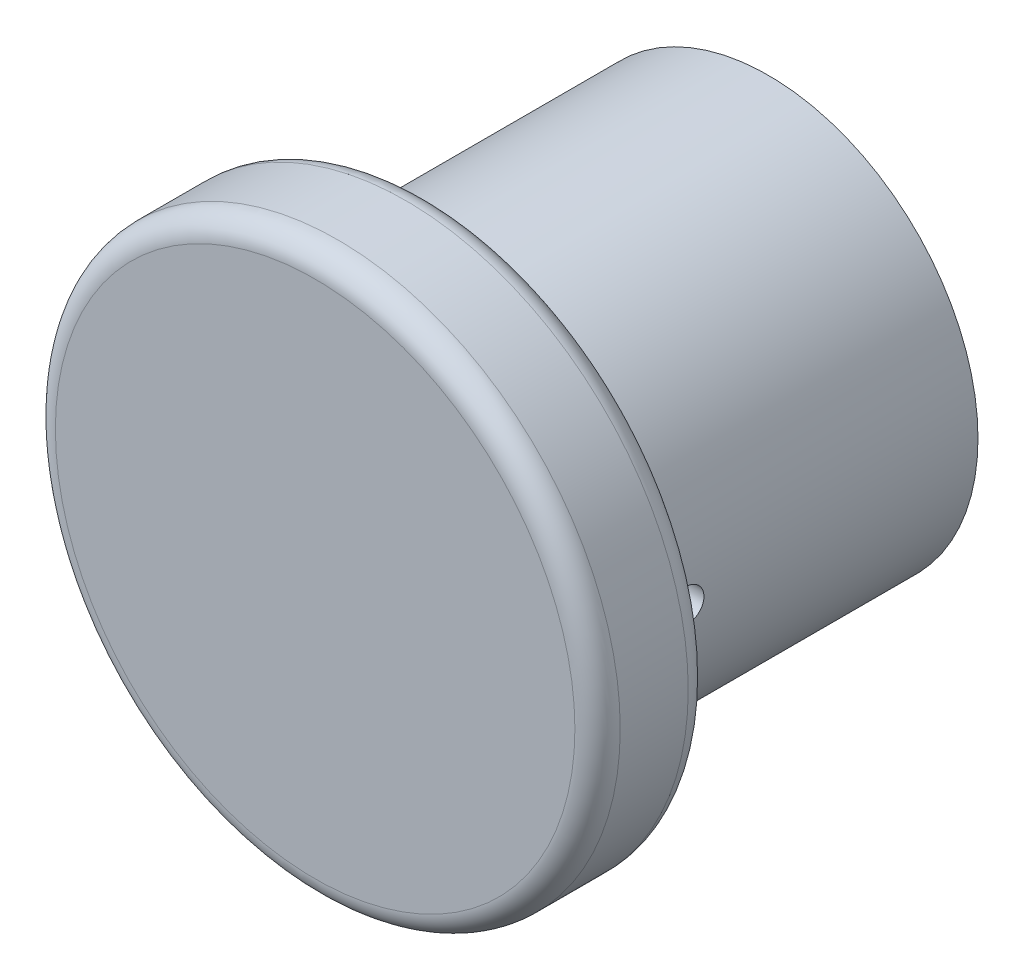
ISO-10303-21;
HEADER;
FILE_DESCRIPTION(('STEP AP214'),'2;1');
FILE_NAME('part.step','',(''),(''),'','','');
FILE_SCHEMA(('AUTOMOTIVE_DESIGN { 1 0 10303 214 1 1 1 1 }'));
ENDSEC;
DATA;
#1=APPLICATION_CONTEXT('core data for automotive mechanical design processes');
#2=APPLICATION_PROTOCOL_DEFINITION('international standard','automotive_design',2000,#1);
#3=PRODUCT_CONTEXT('',#1,'mechanical');
#4=PRODUCT('Part','Part','',(#3));
#5=PRODUCT_RELATED_PRODUCT_CATEGORY('part','',(#4));
#6=PRODUCT_DEFINITION_FORMATION('','',#4);
#7=PRODUCT_DEFINITION_CONTEXT('part definition',#1,'design');
#8=PRODUCT_DEFINITION('design','',#6,#7);
#9=PRODUCT_DEFINITION_SHAPE('','',#8);
#10=(LENGTH_UNIT() NAMED_UNIT(*) SI_UNIT(.MILLI.,.METRE.));
#11=(NAMED_UNIT(*) PLANE_ANGLE_UNIT() SI_UNIT($,.RADIAN.));
#12=(NAMED_UNIT(*) SI_UNIT($,.STERADIAN.) SOLID_ANGLE_UNIT());
#13=UNCERTAINTY_MEASURE_WITH_UNIT(LENGTH_MEASURE(1.E-05),#10,'distance_accuracy_value','');
#14=(GEOMETRIC_REPRESENTATION_CONTEXT(3) GLOBAL_UNCERTAINTY_ASSIGNED_CONTEXT((#13)) GLOBAL_UNIT_ASSIGNED_CONTEXT((#10,
#11,#12)) REPRESENTATION_CONTEXT('',''));
#15=CARTESIAN_POINT('',(0.,0.,0.));
#16=DIRECTION('',(0.,0.,1.));
#17=DIRECTION('',(1.,0.,0.));
#18=AXIS2_PLACEMENT_3D('',#15,#16,#17);
#19=CARTESIAN_POINT('',(0.,0.,0.));
#20=DIRECTION('',(0.,0.,1.));
#21=DIRECTION('',(1.,0.,0.));
#22=AXIS2_PLACEMENT_3D('',#19,#20,#21);
#23=PLANE('',#22);
#24=CARTESIAN_POINT('',(0.,0.,0.));
#25=DIRECTION('',(0.,0.,1.));
#26=DIRECTION('',(1.,0.,0.));
#27=AXIS2_PLACEMENT_3D('',#24,#25,#26);
#28=CIRCLE('',#27,11.461427854);
#29=CARTESIAN_POINT('',(11.461427854,0.,0.));
#30=VERTEX_POINT('',#29);
#31=EDGE_CURVE('E52',#30,#30,#28,.F.);
#32=ORIENTED_EDGE('',*,*,#31,.T.);
#33=EDGE_LOOP('',(#32));
#34=FACE_BOUND('',#33,.T.);
#35=CARTESIAN_POINT('',(0.,0.,0.));
#36=DIRECTION('',(0.,0.,1.));
#37=DIRECTION('',(1.,0.,0.));
#38=AXIS2_PLACEMENT_3D('',#35,#36,#37);
#39=CIRCLE('',#38,10.246210184);
#40=CARTESIAN_POINT('',(10.246210184,0.,0.));
#41=VERTEX_POINT('',#40);
#42=EDGE_CURVE('E55',#41,#41,#39,.T.);
#43=ORIENTED_EDGE('',*,*,#42,.T.);
#44=EDGE_LOOP('',(#43));
#45=FACE_BOUND('',#44,.T.);
#46=ADVANCED_FACE('F32',(#34,#45),#23,.F.);
#47=CARTESIAN_POINT('',(0.,0.,5.));
#48=DIRECTION('',(0.,0.,-1.));
#49=DIRECTION('',(-1.,0.,0.));
#50=AXIS2_PLACEMENT_3D('',#47,#48,#49);
#51=CYLINDRICAL_SURFACE('',#50,12.461427854);
#52=CARTESIAN_POINT('',(0.,0.,1.));
#53=DIRECTION('',(0.,0.,1.));
#54=DIRECTION('',(1.,0.,0.));
#55=AXIS2_PLACEMENT_3D('',#52,#53,#54);
#56=CIRCLE('',#55,12.461427854);
#57=CARTESIAN_POINT('',(12.461427854,0.,1.));
#58=VERTEX_POINT('',#57);
#59=EDGE_CURVE('E43',#58,#58,#56,.T.);
#60=ORIENTED_EDGE('',*,*,#59,.T.);
#61=EDGE_LOOP('',(#60));
#62=FACE_BOUND('',#61,.T.);
#63=CARTESIAN_POINT('',(0.,0.,4.));
#64=DIRECTION('',(0.,0.,1.));
#65=DIRECTION('',(1.,0.,0.));
#66=AXIS2_PLACEMENT_3D('',#63,#64,#65);
#67=CIRCLE('',#66,12.461427854);
#68=CARTESIAN_POINT('',(12.461427854,0.,4.));
#69=VERTEX_POINT('',#68);
#70=EDGE_CURVE('E47',#69,#69,#67,.F.);
#71=ORIENTED_EDGE('',*,*,#70,.T.);
#72=EDGE_LOOP('',(#71));
#73=FACE_BOUND('',#72,.T.);
#74=ADVANCED_FACE('F34',(#62,#73),#51,.T.);
#75=CARTESIAN_POINT('',(0.,0.,5.));
#76=DIRECTION('',(0.,0.,1.));
#77=DIRECTION('',(1.,0.,0.));
#78=AXIS2_PLACEMENT_3D('',#75,#76,#77);
#79=PLANE('',#78);
#80=CARTESIAN_POINT('',(0.,0.,5.));
#81=DIRECTION('',(0.,0.,1.));
#82=DIRECTION('',(1.,0.,0.));
#83=AXIS2_PLACEMENT_3D('',#80,#81,#82);
#84=CIRCLE('',#83,11.461427854);
#85=CARTESIAN_POINT('',(11.461427854,0.,5.));
#86=VERTEX_POINT('',#85);
#87=EDGE_CURVE('E11',#86,#86,#84,.T.);
#88=ORIENTED_EDGE('',*,*,#87,.T.);
#89=EDGE_LOOP('',(#88));
#90=FACE_BOUND('',#89,.T.);
#91=ADVANCED_FACE('F100',(#90),#79,.T.);
#92=CARTESIAN_POINT('',(0.,0.,-15.));
#93=DIRECTION('',(0.,0.,1.));
#94=DIRECTION('',(1.,0.,0.));
#95=AXIS2_PLACEMENT_3D('',#92,#93,#94);
#96=CYLINDRICAL_SURFACE('',#95,9.246210184);
#97=CARTESIAN_POINT('',(0.,0.,-1.));
#98=DIRECTION('',(0.,0.,1.));
#99=DIRECTION('',(1.,0.,0.));
#100=AXIS2_PLACEMENT_3D('',#97,#98,#99);
#101=CIRCLE('',#100,9.246210184);
#102=CARTESIAN_POINT('',(9.246210184,0.,-1.));
#103=VERTEX_POINT('',#102);
#104=EDGE_CURVE('E39',#103,#103,#101,.F.);
#105=ORIENTED_EDGE('',*,*,#104,.T.);
#106=EDGE_LOOP('',(#105));
#107=FACE_BOUND('',#106,.T.);
#108=CARTESIAN_POINT('',(9.246210184,0.,-2.909005151));
#109=CARTESIAN_POINT('',(9.24620979681304,-0.0413957006711444,-2.90900334028285));
#110=CARTESIAN_POINT('',(9.24592922303125,-0.0828197328417742,-2.90551156817986));
#111=CARTESIAN_POINT('',(9.2448369344386,-0.164522110775543,-2.89163336871054));
#112=CARTESIAN_POINT('',(9.24402461480983,-0.204799097365389,-2.88123909010611));
#113=CARTESIAN_POINT('',(9.24196064919478,-0.283012224778952,-2.853857989299));
#114=CARTESIAN_POINT('',(9.24070924868002,-0.320949659642295,-2.83687485008955));
#115=CARTESIAN_POINT('',(9.23790753586561,-0.393426148978988,-2.79680459425711));
#116=CARTESIAN_POINT('',(9.23635728836858,-0.427965937757503,-2.77371880054487));
#117=CARTESIAN_POINT('',(9.23312781758184,-0.492757147757313,-2.72203980952776));
#118=CARTESIAN_POINT('',(9.2314483322434,-0.522999482157884,-2.69343523523433));
#119=CARTESIAN_POINT('',(9.22815187947331,-0.578259385016817,-2.63155462767365));
#120=CARTESIAN_POINT('',(9.2265349147647,-0.603276726112222,-2.59827839122667));
#121=CARTESIAN_POINT('',(9.22354371913614,-0.647406877193839,-2.52794451230455));
#122=CARTESIAN_POINT('',(9.22216981510871,-0.666511760984308,-2.49088188153927));
#123=CARTESIAN_POINT('',(9.21982322430151,-0.698224038797599,-2.41406208508506));
#124=CARTESIAN_POINT('',(9.21885053095775,-0.710831539121319,-2.37430496349158));
#125=CARTESIAN_POINT('',(9.21741864500708,-0.729164965982102,-2.29331533625684));
#126=CARTESIAN_POINT('',(9.21695835338318,-0.734905622743441,-2.2520861848093));
#127=CARTESIAN_POINT('',(9.21659989400513,-0.739387906396724,-2.16924713485922));
#128=CARTESIAN_POINT('',(9.21670171648738,-0.738129654855505,-2.12763724298246));
#129=CARTESIAN_POINT('',(9.21745498376225,-0.728662020913646,-2.04531870103828));
#130=CARTESIAN_POINT('',(9.21810516378412,-0.720468634044991,-2.00460819810095));
#131=CARTESIAN_POINT('',(9.21987989969181,-0.697388152921827,-1.92514211519331));
#132=CARTESIAN_POINT('',(9.22100445987682,-0.682500998003543,-1.88638655294362));
#133=CARTESIAN_POINT('',(9.22360269840569,-0.646437616125899,-1.81187942516979));
#134=CARTESIAN_POINT('',(9.22507677556543,-0.62525419777085,-1.77613135493921));
#135=CARTESIAN_POINT('',(9.22820757801592,-0.577204797034953,-1.70869218842976));
#136=CARTESIAN_POINT('',(9.22986430669737,-0.550338709153741,-1.67700116748868));
#137=CARTESIAN_POINT('',(9.23317935969137,-0.491596814295881,-1.61848267485407));
#138=CARTESIAN_POINT('',(9.23483767546002,-0.459707176252819,-1.59166908458135));
#139=CARTESIAN_POINT('',(9.23796461528914,-0.391871707067114,-1.54377387287056));
#140=CARTESIAN_POINT('',(9.23943323923609,-0.35592587349732,-1.52269225486243));
#141=CARTESIAN_POINT('',(9.24201556511307,-0.280989473110397,-1.48686033941056));
#142=CARTESIAN_POINT('',(9.24312923351135,-0.24199861907093,-1.47211064008128));
#143=CARTESIAN_POINT('',(9.24487577158201,-0.162083054255314,-1.44937088676647));
#144=CARTESIAN_POINT('',(9.24550865041336,-0.121158380334004,-1.44138070401255));
#145=CARTESIAN_POINT('',(9.24622112415009,-0.0386572204441502,-1.43240416165275));
#146=CARTESIAN_POINT('',(9.24630223400072,0.00291716641788696,-1.43139862473734));
#147=CARTESIAN_POINT('',(9.24590607381375,0.0856433621780159,-1.43636970416433));
#148=CARTESIAN_POINT('',(9.24542880855119,0.12679517468677,-1.44234626079848));
#149=CARTESIAN_POINT('',(9.24397055649382,0.207453515472858,-1.46109598302385));
#150=CARTESIAN_POINT('',(9.24299022729705,0.246962119023409,-1.47386027657006));
#151=CARTESIAN_POINT('',(9.24063600421867,0.323276779037239,-1.50581408934175));
#152=CARTESIAN_POINT('',(9.23926210461059,0.36008279616792,-1.52500370205672));
#153=CARTESIAN_POINT('',(9.23627104471685,0.430034871348462,-1.56931174075535));
#154=CARTESIAN_POINT('',(9.23465336509929,0.463172847354418,-1.59444289080767));
#155=CARTESIAN_POINT('',(9.23135829551876,0.524766633506035,-1.64990221660154));
#156=CARTESIAN_POINT('',(9.22968090460374,0.553222368956211,-1.68023047523648));
#157=CARTESIAN_POINT('',(9.22645099655604,0.604709548897802,-1.74530623915026));
#158=CARTESIAN_POINT('',(9.22489877250828,0.627728492626714,-1.78006365144153));
#159=CARTESIAN_POINT('',(9.22209901612682,0.66760299192344,-1.85296168641901));
#160=CARTESIAN_POINT('',(9.22085148096589,0.684458604682284,-1.8911022777078));
#161=CARTESIAN_POINT('',(9.21880394361962,0.711506612142999,-1.96963947461986));
#162=CARTESIAN_POINT('',(9.2180034249134,0.721706699512693,-2.0100334168938));
#163=CARTESIAN_POINT('',(9.21693879418459,0.735179173960342,-2.09196724746068));
#164=CARTESIAN_POINT('',(9.21667467280037,0.738451681944009,-2.13350711574117));
#165=CARTESIAN_POINT('',(9.21671286294041,0.737974755269766,-2.21642939599194));
#166=CARTESIAN_POINT('',(9.21701358993698,0.734244963662479,-2.25781192308927));
#167=CARTESIAN_POINT('',(9.21814422724268,0.719910229217425,-2.33936088096303));
#168=CARTESIAN_POINT('',(9.21897413839189,0.709305275465128,-2.37952730980876));
#169=CARTESIAN_POINT('',(9.22106921980387,0.681526135888463,-2.45750546197172));
#170=CARTESIAN_POINT('',(9.22233436963839,0.664352258377026,-2.49531729570523));
#171=CARTESIAN_POINT('',(9.22515740248264,0.62392503598291,-2.56752416391765));
#172=CARTESIAN_POINT('',(9.22671528034081,0.600671798084684,-2.60191925850957));
#173=CARTESIAN_POINT('',(9.22995341725427,0.548672209898182,-2.66641673353455));
#174=CARTESIAN_POINT('',(9.23163399209048,0.519911352693741,-2.69650740215557));
#175=CARTESIAN_POINT('',(9.23492529388641,0.457738484081998,-2.75144593250129));
#176=CARTESIAN_POINT('',(9.23653600381246,0.424325346674816,-2.77629252131808));
#177=CARTESIAN_POINT('',(9.2395087570129,0.353737031003558,-2.82006801681227));
#178=CARTESIAN_POINT('',(9.24087036219781,0.316555400309012,-2.83898653891305));
#179=CARTESIAN_POINT('',(9.24318624766919,0.239558189331896,-2.87028803393946));
#180=CARTESIAN_POINT('',(9.24414099758556,0.199745707498057,-2.88267854602448));
#181=CARTESIAN_POINT('',(9.24528953955913,0.133080572758016,-2.89740449433433));
#182=CARTESIAN_POINT('',(9.24563321657674,0.106657087647965,-2.90174898809923));
#183=CARTESIAN_POINT('',(9.24609366363651,0.0534930120971895,-2.90754989806066));
#184=CARTESIAN_POINT('',(9.24621043422379,0.0267524224184529,-2.90900632119568));
#185=CARTESIAN_POINT('',(9.246210184,0.,-2.909005151));
#186=B_SPLINE_CURVE_WITH_KNOTS('',3,(#108,#109,#110,#111,#112,#113,#114,#115,#116,#117,#118,
#119,#120,#121,#122,#123,#124,#125,#126,#127,#128,#129,#130,#131,#132,#133,#134,#135,#136,#137,
#138,#139,#140,#141,#142,#143,#144,#145,#146,#147,#148,#149,#150,#151,#152,#153,#154,#155,#156,
#157,#158,#159,#160,#161,#162,#163,#164,#165,#166,#167,#168,#169,#170,#171,#172,#173,#174,#175,
#176,#177,#178,#179,#180,#181,#182,#183,#184,#185),.UNSPECIFIED.,.T.,.F.,(4,2,2,2,2,2,2,2,2,2,2,
2,2,2,2,2,2,2,2,2,2,2,2,2,2,2,2,2,2,2,2,2,2,2,2,2,2,2,4),(0.,0.124089428973199,
0.248320245459998,0.37248172012995,0.49661630157767,0.621009575418145,0.745408261042161,
0.869972999332525,0.994535699608033,1.1188307156226,1.24312357271411,1.36713053345762,
1.4911386180647,1.61528888871003,1.73944146444251,1.8639420374305,1.98844268491766,
2.11295509017742,2.23746512342962,2.36163316158654,2.48580013791265,2.60980521682779,
2.73381210011647,2.85808699446291,2.98236387116667,3.10692377368344,3.23148252034959,
3.35589704182504,3.48030939189983,3.60437325829102,3.72843732163787,3.85249556274296,
3.97655162082073,4.10093904896993,4.22535663533834,4.34999096907339,4.47448104608628,
4.55467538373997,4.63486952872927),.UNSPECIFIED.);
#187=CARTESIAN_POINT('',(9.246210184,0.,-2.909005151));
#188=VERTEX_POINT('',#187);
#189=EDGE_CURVE('E85',#188,#188,#186,.T.);
#190=ORIENTED_EDGE('',*,*,#189,.T.);
#191=EDGE_LOOP('',(#190));
#192=FACE_BOUND('',#191,.T.);
#193=CARTESIAN_POINT('',(-9.21669281645345,0.738225096999999,-2.170780054));
#194=CARTESIAN_POINT('',(-9.21669320825936,0.738223286068986,-2.12938459044424));
#195=CARTESIAN_POINT('',(-9.2169747009429,0.734731552615201,-2.08796079461329));
#196=CARTESIAN_POINT('',(-9.21807027252276,0.720853520624961,-2.00625890774605));
#197=CARTESIAN_POINT('',(-9.2188849579531,0.710459370038573,-1.96598217606837));
#198=CARTESIAN_POINT('',(-9.22095405631546,0.683078643750472,-1.88776958758654));
#199=CARTESIAN_POINT('',(-9.22220822314012,0.66609575713864,-1.84983243458393));
#200=CARTESIAN_POINT('',(-9.22501466227787,0.626026096092014,-1.77735641719984));
#201=CARTESIAN_POINT('',(-9.22656686999235,0.602940643944595,-1.74281681886726));
#202=CARTESIAN_POINT('',(-9.22979862606728,0.551261997409054,-1.67802539250336));
#203=CARTESIAN_POINT('',(-9.23147843474757,0.522657349776053,-1.6477827119281));
#204=CARTESIAN_POINT('',(-9.23477373045719,0.460776450364639,-1.59252214132393));
#205=CARTESIAN_POINT('',(-9.23638921469808,0.427499996349025,-1.56750447759676));
#206=CARTESIAN_POINT('',(-9.23937627555897,0.357165928105456,-1.52337399016672));
#207=CARTESIAN_POINT('',(-9.24074752621421,0.320103362990698,-1.50426903311898));
#208=CARTESIAN_POINT('',(-9.24308882001091,0.243283709262382,-1.47255660173876));
#209=CARTESIAN_POINT('',(-9.24405886966206,0.203526664380228,-1.45994902198242));
#210=CARTESIAN_POINT('',(-9.24548664641197,0.122537266686262,-1.44161542761594));
#211=CARTESIAN_POINT('',(-9.2459454704878,0.08130826945857,-1.4358746763542));
#212=CARTESIAN_POINT('',(-9.24630281280588,-0.00153047892601577,-1.43139215027259));
#213=CARTESIAN_POINT('',(-9.24620134069927,-0.0431402235121816,-1.43265025489692));
#214=CARTESIAN_POINT('',(-9.24545043069278,-0.125459416426342,-1.44211765736891));
#215=CARTESIAN_POINT('',(-9.24480224208432,-0.166170700350792,-1.4503111075425));
#216=CARTESIAN_POINT('',(-9.24303225533334,-0.245638312588028,-1.47339198643042));
#217=CARTESIAN_POINT('',(-9.24191045299932,-0.284394623595891,-1.48827947438711));
#218=CARTESIAN_POINT('',(-9.23931731152195,-0.358902654612218,-1.52434354350234));
#219=CARTESIAN_POINT('',(-9.23784557741219,-0.394650917270368,-1.54552723796527));
#220=CARTESIAN_POINT('',(-9.23471800933415,-0.462090351312153,-1.59357722674771));
#221=CARTESIAN_POINT('',(-9.2330621719432,-0.493781447245484,-1.6204436267227));
#222=CARTESIAN_POINT('',(-9.22974708241243,-0.552299583115608,-1.67918574154527));
#223=CARTESIAN_POINT('',(-9.22808783363569,-0.579112804768463,-1.71107522409993));
#224=CARTESIAN_POINT('',(-9.22495758569502,-0.627007347032932,-1.77891025136265));
#225=CARTESIAN_POINT('',(-9.22348658666843,-0.648088663462733,-1.81485579902985));
#226=CARTESIAN_POINT('',(-9.22089909087446,-0.683920362496379,-1.88979212496288));
#227=CARTESIAN_POINT('',(-9.21978263284637,-0.698670053330378,-1.92878323542577));
#228=CARTESIAN_POINT('',(-9.21803135180374,-0.721409710944458,-2.00869935716079));
#229=CARTESIAN_POINT('',(-9.21739651950483,-0.729399808030662,-2.04962433113736));
#230=CARTESIAN_POINT('',(-9.21668184532479,-0.738376027716207,-2.13212562583757));
#231=CARTESIAN_POINT('',(-9.21660047744746,-0.739381408538695,-2.17369983859153));
#232=CARTESIAN_POINT('',(-9.21699791572631,-0.734410079082333,-2.25642564852937));
#233=CARTESIAN_POINT('',(-9.21747671709247,-0.728433428507043,-2.29757724932399));
#234=CARTESIAN_POINT('',(-9.21893915183374,-0.709683735556499,-2.37823456117695));
#235=CARTESIAN_POINT('',(-9.2199221192162,-0.696919658412346,-2.41774236940162));
#236=CARTESIAN_POINT('',(-9.22228157333734,-0.664966545108523,-2.49405553463093));
#237=CARTESIAN_POINT('',(-9.22365806587991,-0.645777414188504,-2.53086085176792));
#238=CARTESIAN_POINT('',(-9.22665317127955,-0.601470080486451,-2.60081245732505));
#239=CARTESIAN_POINT('',(-9.22827230591742,-0.576339031140444,-2.63395058605831));
#240=CARTESIAN_POINT('',(-9.23156848057734,-0.520879819093251,-2.69554472733528));
#241=CARTESIAN_POINT('',(-9.23324552151452,-0.490551574229715,-2.72400066584441));
#242=CARTESIAN_POINT('',(-9.23647307566463,-0.425475720160148,-2.77548827415093));
#243=CARTESIAN_POINT('',(-9.23802329196896,-0.390718201795636,-2.79850744079927));
#244=CARTESIAN_POINT('',(-9.24081825264887,-0.31781989622062,-2.83838233142641));
#245=CARTESIAN_POINT('',(-9.24206299986094,-0.279679140430195,-2.85523811263706));
#246=CARTESIAN_POINT('',(-9.24410539840819,-0.201142055820546,-2.8822862338078));
#247=CARTESIAN_POINT('',(-9.24490357063614,-0.160748415564235,-2.892486339382));
#248=CARTESIAN_POINT('',(-9.24596499552121,-0.0788152211152302,-2.9059589526136));
#249=CARTESIAN_POINT('',(-9.2462282573901,-0.0372756866686221,-2.90923157957008));
#250=CARTESIAN_POINT('',(-9.24619021623849,0.0456468061041731,-2.90875499554916));
#251=CARTESIAN_POINT('',(-9.24589048107252,0.0870298786251457,-2.90502528494826));
#252=CARTESIAN_POINT('',(-9.24476323056729,0.168579947314813,-2.89069052043963));
#253=CARTESIAN_POINT('',(-9.24393571446466,0.208746941724514,-2.88008545658756));
#254=CARTESIAN_POINT('',(-9.24184577891097,0.286726211806898,-2.85230588829605));
#255=CARTESIAN_POINT('',(-9.24058337967976,0.324538596860432,-2.83513168928385));
#256=CARTESIAN_POINT('',(-9.23776500357581,0.396746433237326,-2.79470365356279));
#257=CARTESIAN_POINT('',(-9.23620903189855,0.431141945014171,-2.77144992444329));
#258=CARTESIAN_POINT('',(-9.23297306836474,0.495639383979399,-2.71944980089091));
#259=CARTESIAN_POINT('',(-9.23129275872437,0.52572968941633,-2.69068901154331));
#260=CARTESIAN_POINT('',(-9.22800019322296,0.580667518749798,-2.62851642739334));
#261=CARTESIAN_POINT('',(-9.22638795397305,0.605513768794108,-2.59510350578881));
#262=CARTESIAN_POINT('',(-9.22341099677267,0.649288905327082,-2.52451536098843));
#263=CARTESIAN_POINT('',(-9.22204671757306,0.668207344895844,-2.48733364671698));
#264=CARTESIAN_POINT('',(-9.21972553997019,0.699508662370785,-2.4103362574737));
#265=CARTESIAN_POINT('',(-9.21876817180226,0.711899080633674,-2.37052368145914));
#266=CARTESIAN_POINT('',(-9.21761631340675,0.726624760853558,-2.30385879837729));
#267=CARTESIAN_POINT('',(-9.21727158563869,0.730969134024668,-2.27743567807129));
#268=CARTESIAN_POINT('',(-9.21680971083504,0.736769883752476,-2.22427233362167));
#269=CARTESIAN_POINT('',(-9.21669256324662,0.738226267324576,-2.1975321102485));
#270=CARTESIAN_POINT('',(-9.21669281645345,0.738225096999999,-2.170780054));
#271=B_SPLINE_CURVE_WITH_KNOTS('',3,(#193,#194,#195,#196,#197,#198,#199,#200,#201,#202,#203,
#204,#205,#206,#207,#208,#209,#210,#211,#212,#213,#214,#215,#216,#217,#218,#219,#220,#221,#222,
#223,#224,#225,#226,#227,#228,#229,#230,#231,#232,#233,#234,#235,#236,#237,#238,#239,#240,#241,
#242,#243,#244,#245,#246,#247,#248,#249,#250,#251,#252,#253,#254,#255,#256,#257,#258,#259,#260,
#261,#262,#263,#264,#265,#266,#267,#268,#269,#270),.UNSPECIFIED.,.T.,.F.,(4,2,2,2,2,2,2,2,2,2,2,
2,2,2,2,2,2,2,2,2,2,2,2,2,2,2,2,2,2,2,2,2,2,2,2,2,2,2,4),(0.,0.124088716792083,
0.248318836765384,0.372479499380221,0.496613281219045,0.621007486892252,0.745407079110842,
0.869971476215488,0.994533852124024,1.11882842685916,1.24312086061757,1.36713004316913,
1.49114032322585,1.61529124317915,1.73944447160651,1.86394410924065,1.9884438377055,
2.11295716508745,2.2374680921449,2.36163558159375,2.48580200929043,2.60980483658914,
2.73380949283267,2.85808474189525,2.98236195580381,3.10692225080672,3.23148138914095,
3.35589493503449,3.48030633836749,3.60437178990477,3.72843742088775,3.85249728422894,
3.97655495223339,4.10094143430703,4.22535809685833,4.34999280854288,4.47448324035985,
4.55467648160489,4.63486952804714),.UNSPECIFIED.);
#272=CARTESIAN_POINT('',(-9.21669281645345,0.738225096999999,-2.170780054));
#273=VERTEX_POINT('',#272);
#274=EDGE_CURVE('E91',#273,#273,#271,.T.);
#275=ORIENTED_EDGE('',*,*,#274,.T.);
#276=EDGE_LOOP('',(#275));
#277=FACE_BOUND('',#276,.T.);
#278=CARTESIAN_POINT('',(0.,0.,-15.));
#279=DIRECTION('',(0.,0.,-1.));
#280=DIRECTION('',(-1.,0.,0.));
#281=AXIS2_PLACEMENT_3D('',#278,#279,#280);
#282=CIRCLE('',#281,9.246210184);
#283=CARTESIAN_POINT('',(-9.246210184,0.,-15.));
#284=VERTEX_POINT('',#283);
#285=EDGE_CURVE('E212',#284,#284,#282,.T.);
#286=ORIENTED_EDGE('',*,*,#285,.F.);
#287=EDGE_LOOP('',(#286));
#288=FACE_BOUND('',#287,.T.);
#289=ADVANCED_FACE('F95',(#107,#192,#277,#288),#96,.T.);
#290=CARTESIAN_POINT('',(0.,0.,-15.));
#291=DIRECTION('',(0.,0.,-1.));
#292=DIRECTION('',(-1.,0.,0.));
#293=AXIS2_PLACEMENT_3D('',#290,#291,#292);
#294=PLANE('',#293);
#295=CARTESIAN_POINT('',(0.,0.,-15.));
#296=DIRECTION('',(0.,0.,-1.));
#297=DIRECTION('',(-1.,0.,0.));
#298=AXIS2_PLACEMENT_3D('',#295,#296,#297);
#299=CIRCLE('',#298,6.4135);
#300=CARTESIAN_POINT('',(-6.4135,0.,-15.));
#301=VERTEX_POINT('',#300);
#302=EDGE_CURVE('E209',#301,#301,#299,.T.);
#303=ORIENTED_EDGE('',*,*,#302,.F.);
#304=EDGE_LOOP('',(#303));
#305=FACE_BOUND('',#304,.T.);
#306=ORIENTED_EDGE('',*,*,#285,.T.);
#307=EDGE_LOOP('',(#306));
#308=FACE_BOUND('',#307,.T.);
#309=ADVANCED_FACE('F99',(#305,#308),#294,.T.);
#310=CARTESIAN_POINT('',(0.,0.,-1.273320156));
#311=DIRECTION('',(0.,0.,-1.));
#312=DIRECTION('',(-1.,0.,0.));
#313=AXIS2_PLACEMENT_3D('',#310,#311,#312);
#314=CYLINDRICAL_SURFACE('',#313,6.4135);
#315=CARTESIAN_POINT('',(6.4135,0.,-2.909005151));
#316=CARTESIAN_POINT('',(6.413499461932,0.041319815573327,-2.90900338039269));
#317=CARTESIAN_POINT('',(6.41309645933487,0.0826660849788551,-2.90552434207659));
#318=CARTESIAN_POINT('',(6.41152756100028,0.164209889970608,-2.89169968113161));
#319=CARTESIAN_POINT('',(6.41036085014741,0.204406150241365,-2.88134672171109));
#320=CARTESIAN_POINT('',(6.40739608333767,0.282457479848701,-2.85408173823856));
#321=CARTESIAN_POINT('',(6.40559843406974,0.320314038862455,-2.83717393855932));
#322=CARTESIAN_POINT('',(6.40157217757349,0.392644531890362,-2.79728804184963));
#323=CARTESIAN_POINT('',(6.39934364923704,0.427119083394685,-2.77431105577647));
#324=CARTESIAN_POINT('',(6.39469307795641,0.49187670367857,-2.72282334571106));
#325=CARTESIAN_POINT('',(6.39227026295408,0.522141595778632,-2.69428982786146));
#326=CARTESIAN_POINT('',(6.38751047573357,0.577464366814313,-2.63254785645992));
#327=CARTESIAN_POINT('',(6.38517350771862,0.602521991071016,-2.59933917438656));
#328=CARTESIAN_POINT('',(6.38084232138467,0.646785363309562,-2.5290730943406));
#329=CARTESIAN_POINT('',(6.37884909430741,0.665974306971266,-2.49200504431261));
#330=CARTESIAN_POINT('',(6.37544104160633,0.697848310177538,-2.41514594438217));
#331=CARTESIAN_POINT('',(6.37402619729994,0.710533579803234,-2.37535498248204));
#332=CARTESIAN_POINT('',(6.37194234277937,0.728985426312856,-2.29436703777365));
#333=CARTESIAN_POINT('',(6.37127004642711,0.734782495569596,-2.25317708818351));
#334=CARTESIAN_POINT('',(6.37073730111177,0.739387697738213,-2.17040384968912));
#335=CARTESIAN_POINT('',(6.37087682428995,0.738196070477089,-2.12882057433129));
#336=CARTESIAN_POINT('',(6.37194894787589,0.72888277768643,-2.04665260605374));
#337=CARTESIAN_POINT('',(6.37287771868002,0.720794575217077,-2.00606406324049));
#338=CARTESIAN_POINT('',(6.37541771373876,0.697969876817049,-1.92682428770977));
#339=CARTESIAN_POINT('',(6.37702894988851,0.683233265006632,-1.88817308877265));
#340=CARTESIAN_POINT('',(6.38075670293304,0.647493690752291,-1.81380046977354));
#341=CARTESIAN_POINT('',(6.38287440038015,0.626476058358735,-1.77808616090109));
#342=CARTESIAN_POINT('',(6.38737552088041,0.578781569621393,-1.71067899778857));
#343=CARTESIAN_POINT('',(6.38975895424288,0.552104493681407,-1.67898629967024));
#344=CARTESIAN_POINT('',(6.3945400402593,0.493662318084716,-1.62032767224748));
#345=CARTESIAN_POINT('',(6.39693769448507,0.461868351083447,-1.59339049554134));
#346=CARTESIAN_POINT('',(6.40146396855923,0.394194656012881,-1.54523100087286));
#347=CARTESIAN_POINT('',(6.40359258793687,0.358314920794683,-1.52400869291009));
#348=CARTESIAN_POINT('',(6.40734200000993,0.28346696004429,-1.48788183475825));
#349=CARTESIAN_POINT('',(6.40896265955749,0.244497928085178,-1.47297894067108));
#350=CARTESIAN_POINT('',(6.41151228659127,0.164587827597136,-1.44993603204208));
#351=CARTESIAN_POINT('',(6.41244128151163,0.123646837352386,-1.4417957492671));
#352=CARTESIAN_POINT('',(6.41349936002436,0.0412037562888255,-1.43254606811375));
#353=CARTESIAN_POINT('',(6.41363295303596,-0.000293831960278608,-1.4313970330243));
#354=CARTESIAN_POINT('',(6.41309731559918,-0.0828903954127562,-1.43605807203975));
#355=CARTESIAN_POINT('',(6.41242809959676,-0.123989377775334,-1.44186802092286));
#356=CARTESIAN_POINT('',(6.41036487465974,-0.204506202079257,-1.46024919419914));
#357=CARTESIAN_POINT('',(6.40897287666657,-0.243928381700368,-1.4728016627166));
#358=CARTESIAN_POINT('',(6.40562005834103,-0.320107885296504,-1.50429215222871));
#359=CARTESIAN_POINT('',(6.40365922140944,-0.356865131467307,-1.52323035956744));
#360=CARTESIAN_POINT('',(6.39937638379948,-0.426849313225353,-1.56705165084248));
#361=CARTESIAN_POINT('',(6.39705283083849,-0.460059991230372,-1.59196054447642));
#362=CARTESIAN_POINT('',(6.39230974183385,-0.521843255404975,-1.64697941604903));
#363=CARTESIAN_POINT('',(6.38989020257944,-0.550415686261155,-1.67708956808408));
#364=CARTESIAN_POINT('',(6.38521406724945,-0.602250757004878,-1.74183015254711));
#365=CARTESIAN_POINT('',(6.38295830973618,-0.625487230925524,-1.77648160423813));
#366=CARTESIAN_POINT('',(6.37887852614455,-0.665810401778675,-1.84921846217662));
#367=CARTESIAN_POINT('',(6.37705449254365,-0.682897205868366,-1.88730380857448));
#368=CARTESIAN_POINT('',(6.37405021683447,-0.710393031417217,-1.96574069143066));
#369=CARTESIAN_POINT('',(6.37286852027182,-0.720817148807325,-2.00608687799632));
#370=CARTESIAN_POINT('',(6.37127841100819,-0.734740475377282,-2.08797135515778));
#371=CARTESIAN_POINT('',(6.37086996821,-0.738239954083717,-2.12950959929147));
#372=CARTESIAN_POINT('',(6.37087339174843,-0.738210231495495,-2.21233887669333));
#373=CARTESIAN_POINT('',(6.37128046094789,-0.734722133665385,-2.25362993098964));
#374=CARTESIAN_POINT('',(6.37285876514772,-0.720902951535219,-2.33503498614529));
#375=CARTESIAN_POINT('',(6.37403000059158,-0.710571863263758,-2.37514898632149));
#376=CARTESIAN_POINT('',(6.37700325036813,-0.683372193584081,-2.4530579564572));
#377=CARTESIAN_POINT('',(6.37880510452964,-0.666505272099058,-2.49085351241739));
#378=CARTESIAN_POINT('',(6.38283686012919,-0.626716815713498,-2.56308416889439));
#379=CARTESIAN_POINT('',(6.38506676368411,-0.603795250869893,-2.59751925279092));
#380=CARTESIAN_POINT('',(6.38971909225683,-0.552394757271715,-2.66226190435996));
#381=CARTESIAN_POINT('',(6.39214253357286,-0.523885169482121,-2.69254505943608));
#382=CARTESIAN_POINT('',(6.39689975442467,-0.462180931176548,-2.74791396133304));
#383=CARTESIAN_POINT('',(6.39923351255148,-0.428985170718383,-2.7729984733466));
#384=CARTESIAN_POINT('',(6.40355662050384,-0.358729127661544,-2.81732557613836));
#385=CARTESIAN_POINT('',(6.40554482694072,-0.32165664196923,-2.83654892554746));
#386=CARTESIAN_POINT('',(6.40894095390853,-0.244808878828951,-2.86847075108128));
#387=CARTESIAN_POINT('',(6.41034951469406,-0.20503664032299,-2.88117643022407));
#388=CARTESIAN_POINT('',(6.41208199124541,-0.137541817797585,-2.89660705956772));
#389=CARTESIAN_POINT('',(6.41261120112522,-0.110247466937522,-2.90124980255433));
#390=CARTESIAN_POINT('',(6.4133203845582,-0.0553060271274799,-2.90744943176112));
#391=CARTESIAN_POINT('',(6.41350036017563,-0.0276589402634414,-2.90900633622121));
#392=CARTESIAN_POINT('',(6.4135,0.,-2.909005151));
#393=B_SPLINE_CURVE_WITH_KNOTS('',3,(#315,#316,#317,#318,#319,#320,#321,#322,#323,#324,#325,
#326,#327,#328,#329,#330,#331,#332,#333,#334,#335,#336,#337,#338,#339,#340,#341,#342,#343,#344,
#345,#346,#347,#348,#349,#350,#351,#352,#353,#354,#355,#356,#357,#358,#359,#360,#361,#362,#363,
#364,#365,#366,#367,#368,#369,#370,#371,#372,#373,#374,#375,#376,#377,#378,#379,#380,#381,#382,
#383,#384,#385,#386,#387,#388,#389,#390,#391,#392),.UNSPECIFIED.,.T.,.F.,(4,2,2,2,2,2,2,2,2,2,2,
2,2,2,2,2,2,2,2,2,2,2,2,2,2,2,2,2,2,2,2,2,2,2,2,2,2,2,4),(0.,0.123858429967885,
0.247849271616789,0.371760337844509,0.495648737999748,0.620056482954693,0.744470311056847,
0.869237119229157,0.993999896940636,1.11820829806202,1.2424124368215,1.36601732847803,
1.48962437461328,1.61352240411114,1.73742524194648,1.86205330993325,1.98668159598609,
2.11134252268858,2.23599850458674,2.35994708884963,2.48389344278259,2.60749678344601,
2.73110373132609,2.85525495375139,2.97941033256868,3.10416211657767,3.22891172669805,
3.35337767490948,3.47783877845774,3.60156990637323,3.72530110609748,3.84900090204965,
3.97270130976716,4.09710042966919,4.22152906368289,4.34636188706731,4.47105645233332,
4.55396614390818,4.63687534541528),.UNSPECIFIED.);
#394=CARTESIAN_POINT('',(6.4135,0.,-2.909005151));
#395=VERTEX_POINT('',#394);
#396=EDGE_CURVE('E58',#395,#395,#393,.T.);
#397=ORIENTED_EDGE('',*,*,#396,.T.);
#398=EDGE_LOOP('',(#397));
#399=FACE_BOUND('',#398,.T.);
#400=CARTESIAN_POINT('',(-6.4135,0.,-1.432554957));
#401=CARTESIAN_POINT('',(-6.413499461932,0.041319815573327,-1.43255672760731));
#402=CARTESIAN_POINT('',(-6.41309645933487,0.0826660849788551,-1.43603576592341));
#403=CARTESIAN_POINT('',(-6.41152756100028,0.164209889970608,-1.44986042686839));
#404=CARTESIAN_POINT('',(-6.41036085014741,0.204406150241364,-1.46021338628892));
#405=CARTESIAN_POINT('',(-6.40739608333767,0.282457479848701,-1.48747836976144));
#406=CARTESIAN_POINT('',(-6.40559843406974,0.320314038862454,-1.50438616944069));
#407=CARTESIAN_POINT('',(-6.40157217757349,0.392644531890361,-1.54427206615038));
#408=CARTESIAN_POINT('',(-6.39934364923704,0.427119083394685,-1.56724905222353));
#409=CARTESIAN_POINT('',(-6.39469307795641,0.491876703678569,-1.61873676228894));
#410=CARTESIAN_POINT('',(-6.39227026295408,0.522141595778631,-1.64727028013855));
#411=CARTESIAN_POINT('',(-6.38751047573357,0.577464366814312,-1.70901225154009));
#412=CARTESIAN_POINT('',(-6.38517350771862,0.602521991071015,-1.74222093361344));
#413=CARTESIAN_POINT('',(-6.38084232138467,0.64678536330956,-1.81248701365941));
#414=CARTESIAN_POINT('',(-6.37884909430741,0.665974306971264,-1.84955506368739));
#415=CARTESIAN_POINT('',(-6.37544104160633,0.697848310177536,-1.92641416361783));
#416=CARTESIAN_POINT('',(-6.37402619729994,0.710533579803231,-1.96620512551796));
#417=CARTESIAN_POINT('',(-6.37194234277937,0.728985426312853,-2.04719307022635));
#418=CARTESIAN_POINT('',(-6.37127004642711,0.734782495569593,-2.0883830198165));
#419=CARTESIAN_POINT('',(-6.37073730111177,0.73938769773821,-2.17115625831089));
#420=CARTESIAN_POINT('',(-6.37087682428995,0.738196070477085,-2.21273953366871));
#421=CARTESIAN_POINT('',(-6.37194894787589,0.728882777686426,-2.29490750194626));
#422=CARTESIAN_POINT('',(-6.37287771868002,0.720794575217073,-2.33549604475951));
#423=CARTESIAN_POINT('',(-6.37541771373876,0.697969876817044,-2.41473582029024));
#424=CARTESIAN_POINT('',(-6.37702894988851,0.683233265006627,-2.45338701922736));
#425=CARTESIAN_POINT('',(-6.38075670293304,0.647493690752286,-2.52775963822646));
#426=CARTESIAN_POINT('',(-6.38287440038015,0.626476058358729,-2.56347394709891));
#427=CARTESIAN_POINT('',(-6.38737552088041,0.578781569621387,-2.63088111021143));
#428=CARTESIAN_POINT('',(-6.38975895424288,0.552104493681401,-2.66257380832977));
#429=CARTESIAN_POINT('',(-6.3945400402593,0.49366231808471,-2.72123243575252));
#430=CARTESIAN_POINT('',(-6.39693769448507,0.461868351083441,-2.74816961245866));
#431=CARTESIAN_POINT('',(-6.40146396855923,0.394194656012875,-2.79632910712714));
#432=CARTESIAN_POINT('',(-6.40359258793687,0.358314920794676,-2.81755141508991));
#433=CARTESIAN_POINT('',(-6.40734200000993,0.283466960044284,-2.85367827324175));
#434=CARTESIAN_POINT('',(-6.40896265955749,0.244497928085171,-2.86858116732892));
#435=CARTESIAN_POINT('',(-6.41151228659128,0.164587827597129,-2.89162407595792));
#436=CARTESIAN_POINT('',(-6.41244128151163,0.123646837352379,-2.8997643587329));
#437=CARTESIAN_POINT('',(-6.41349936002436,0.0412037562888187,-2.90901403988625));
#438=CARTESIAN_POINT('',(-6.41363295303596,-0.000293831960285323,-2.9101630749757));
#439=CARTESIAN_POINT('',(-6.41309731559918,-0.0828903954127628,-2.90550203596025));
#440=CARTESIAN_POINT('',(-6.41242809959676,-0.12398937777534,-2.89969208707714));
#441=CARTESIAN_POINT('',(-6.41036487465974,-0.204506202079263,-2.88131091380086));
#442=CARTESIAN_POINT('',(-6.40897287666658,-0.243928381700374,-2.8687584452834));
#443=CARTESIAN_POINT('',(-6.40562005834103,-0.32010788529651,-2.83726795577129));
#444=CARTESIAN_POINT('',(-6.40365922140944,-0.356865131467313,-2.81832974843256));
#445=CARTESIAN_POINT('',(-6.39937638379948,-0.426849313225359,-2.77450845715752));
#446=CARTESIAN_POINT('',(-6.39705283083848,-0.460059991230378,-2.74959956352358));
#447=CARTESIAN_POINT('',(-6.39230974183385,-0.521843255404981,-2.69458069195097));
#448=CARTESIAN_POINT('',(-6.38989020257944,-0.550415686261161,-2.66447053991592));
#449=CARTESIAN_POINT('',(-6.38521406724945,-0.602250757004884,-2.59972995545289));
#450=CARTESIAN_POINT('',(-6.38295830973618,-0.625487230925528,-2.56507850376187));
#451=CARTESIAN_POINT('',(-6.37887852614455,-0.66581040177868,-2.49234164582338));
#452=CARTESIAN_POINT('',(-6.37705449254365,-0.682897205868371,-2.45425629942552));
#453=CARTESIAN_POINT('',(-6.37405021683447,-0.710393031417221,-2.37581941656934));
#454=CARTESIAN_POINT('',(-6.37286852027182,-0.720817148807329,-2.33547323000368));
#455=CARTESIAN_POINT('',(-6.37127841100819,-0.734740475377286,-2.25358875284221));
#456=CARTESIAN_POINT('',(-6.37086996821,-0.738239954083721,-2.21205050870853));
#457=CARTESIAN_POINT('',(-6.37087339174843,-0.738210231495498,-2.12922123130667));
#458=CARTESIAN_POINT('',(-6.37128046094789,-0.734722133665388,-2.08793017701036));
#459=CARTESIAN_POINT('',(-6.37285876514772,-0.720902951535221,-2.00652512185471));
#460=CARTESIAN_POINT('',(-6.37403000059158,-0.710571863263761,-1.9664111216785));
#461=CARTESIAN_POINT('',(-6.37700325036813,-0.683372193584083,-1.88850215154279));
#462=CARTESIAN_POINT('',(-6.37880510452964,-0.66650527209906,-1.8507065955826));
#463=CARTESIAN_POINT('',(-6.38283686012919,-0.6267168157135,-1.77847593910561));
#464=CARTESIAN_POINT('',(-6.38506676368411,-0.603795250869894,-1.74404085520908));
#465=CARTESIAN_POINT('',(-6.38971909225683,-0.552394757271717,-1.67929820364004));
#466=CARTESIAN_POINT('',(-6.39214253357286,-0.523885169482122,-1.64901504856392));
#467=CARTESIAN_POINT('',(-6.39689975442467,-0.462180931176549,-1.59364614666696));
#468=CARTESIAN_POINT('',(-6.39923351255148,-0.428985170718384,-1.5685616346534));
#469=CARTESIAN_POINT('',(-6.40355662050384,-0.358729127661544,-1.52423453186164));
#470=CARTESIAN_POINT('',(-6.40554482694072,-0.32165664196923,-1.50501118245254));
#471=CARTESIAN_POINT('',(-6.40894095390853,-0.244808878828951,-1.47308935691872));
#472=CARTESIAN_POINT('',(-6.41034951469406,-0.20503664032299,-1.46038367777593));
#473=CARTESIAN_POINT('',(-6.41208199124541,-0.137541817797585,-1.44495304843228));
#474=CARTESIAN_POINT('',(-6.41261120112522,-0.110247466937522,-1.44031030544567));
#475=CARTESIAN_POINT('',(-6.4133203845582,-0.05530602712748,-1.43411067623888));
#476=CARTESIAN_POINT('',(-6.41350036017563,-0.0276589402634414,-1.43255377177879));
#477=CARTESIAN_POINT('',(-6.4135,0.,-1.432554957));
#478=B_SPLINE_CURVE_WITH_KNOTS('',3,(#400,#401,#402,#403,#404,#405,#406,#407,#408,#409,#410,
#411,#412,#413,#414,#415,#416,#417,#418,#419,#420,#421,#422,#423,#424,#425,#426,#427,#428,#429,
#430,#431,#432,#433,#434,#435,#436,#437,#438,#439,#440,#441,#442,#443,#444,#445,#446,#447,#448,
#449,#450,#451,#452,#453,#454,#455,#456,#457,#458,#459,#460,#461,#462,#463,#464,#465,#466,#467,
#468,#469,#470,#471,#472,#473,#474,#475,#476,#477),.UNSPECIFIED.,.T.,.F.,(4,2,2,2,2,2,2,2,2,2,2,
2,2,2,2,2,2,2,2,2,2,2,2,2,2,2,2,2,2,2,2,2,2,2,2,2,2,2,4),(0.,0.123858429967885,
0.247849271616789,0.371760337844509,0.495648737999748,0.620056482954693,0.744470311056847,
0.869237119229157,0.993999896940635,1.11820829806202,1.2424124368215,1.36601732847803,
1.48962437461328,1.61352240411114,1.73742524194648,1.86205330993325,1.98668159598609,
2.11134252268858,2.23599850458674,2.35994708884963,2.48389344278258,2.607496783446,
2.73110373132609,2.85525495375138,2.97941033256868,3.10416211657767,3.22891172669804,
3.35337767490948,3.47783877845774,3.60156990637322,3.72530110609748,3.84900090204965,
3.97270130976716,4.09710042966918,4.22152906368289,4.34636188706731,4.47105645233331,
4.55396614390818,4.63687534541528),.UNSPECIFIED.);
#479=CARTESIAN_POINT('',(-6.4135,0.,-1.432554957));
#480=VERTEX_POINT('',#479);
#481=EDGE_CURVE('E65',#480,#480,#478,.T.);
#482=ORIENTED_EDGE('',*,*,#481,.T.);
#483=EDGE_LOOP('',(#482));
#484=FACE_BOUND('',#483,.T.);
#485=CARTESIAN_POINT('',(0.,0.,-1.273320156));
#486=DIRECTION('',(0.,0.,-1.));
#487=DIRECTION('',(-1.,0.,0.));
#488=AXIS2_PLACEMENT_3D('',#485,#486,#487);
#489=CIRCLE('',#488,6.4135);
#490=CARTESIAN_POINT('',(-6.4135,0.,-1.273320156));
#491=VERTEX_POINT('',#490);
#492=EDGE_CURVE('E214',#491,#491,#489,.T.);
#493=ORIENTED_EDGE('',*,*,#492,.F.);
#494=EDGE_LOOP('',(#493));
#495=FACE_BOUND('',#494,.T.);
#496=ORIENTED_EDGE('',*,*,#302,.T.);
#497=EDGE_LOOP('',(#496));
#498=FACE_BOUND('',#497,.T.);
#499=ADVANCED_FACE('F70',(#399,#484,#495,#498),#314,.F.);
#500=CARTESIAN_POINT('',(6.4135,0.,-1.273320156));
#501=DIRECTION('',(0.,0.,1.));
#502=DIRECTION('',(1.,0.,0.));
#503=AXIS2_PLACEMENT_3D('',#500,#501,#502);
#504=PLANE('',#503);
#505=ORIENTED_EDGE('',*,*,#492,.T.);
#506=EDGE_LOOP('',(#505));
#507=FACE_BOUND('',#506,.T.);
#508=ADVANCED_FACE('F145',(#507),#504,.F.);
#509=CARTESIAN_POINT('',(-9.246210184,0.,-2.170780054));
#510=DIRECTION('',(1.,0.,0.));
#511=DIRECTION('',(0.,1.,0.));
#512=AXIS2_PLACEMENT_3D('',#509,#510,#511);
#513=CYLINDRICAL_SURFACE('',#512,0.738225096999999);
#514=ORIENTED_EDGE('',*,*,#481,.F.);
#515=EDGE_LOOP('',(#514));
#516=FACE_BOUND('',#515,.T.);
#517=ORIENTED_EDGE('',*,*,#274,.F.);
#518=EDGE_LOOP('',(#517));
#519=FACE_BOUND('',#518,.T.);
#520=ADVANCED_FACE('F79',(#516,#519),#513,.F.);
#521=CARTESIAN_POINT('',(6.37087167946109,0.,-2.170780054));
#522=DIRECTION('',(1.,0.,0.));
#523=DIRECTION('',(0.,0.,-1.));
#524=AXIS2_PLACEMENT_3D('',#521,#522,#523);
#525=CYLINDRICAL_SURFACE('',#524,0.738225096999999);
#526=ORIENTED_EDGE('',*,*,#396,.F.);
#527=EDGE_LOOP('',(#526));
#528=FACE_BOUND('',#527,.T.);
#529=ORIENTED_EDGE('',*,*,#189,.F.);
#530=EDGE_LOOP('',(#529));
#531=FACE_BOUND('',#530,.T.);
#532=ADVANCED_FACE('F74',(#528,#531),#525,.F.);
#533=CARTESIAN_POINT('',(0.,0.,1.));
#534=DIRECTION('',(0.,0.,1.));
#535=DIRECTION('',(1.,0.,0.));
#536=AXIS2_PLACEMENT_3D('',#533,#534,#535);
#537=TOROIDAL_SURFACE('',#536,11.461427854,1.);
#538=ORIENTED_EDGE('',*,*,#59,.F.);
#539=EDGE_LOOP('',(#538));
#540=FACE_BOUND('',#539,.T.);
#541=ORIENTED_EDGE('',*,*,#31,.F.);
#542=EDGE_LOOP('',(#541));
#543=FACE_BOUND('',#542,.T.);
#544=ADVANCED_FACE('F78',(#540,#543),#537,.T.);
#545=CARTESIAN_POINT('',(0.,0.,-1.));
#546=DIRECTION('',(0.,0.,1.));
#547=DIRECTION('',(1.,0.,0.));
#548=AXIS2_PLACEMENT_3D('',#545,#546,#547);
#549=TOROIDAL_SURFACE('',#548,10.246210184,1.);
#550=ORIENTED_EDGE('',*,*,#42,.F.);
#551=EDGE_LOOP('',(#550));
#552=FACE_BOUND('',#551,.T.);
#553=ORIENTED_EDGE('',*,*,#104,.F.);
#554=EDGE_LOOP('',(#553));
#555=FACE_BOUND('',#554,.T.);
#556=ADVANCED_FACE('F117',(#552,#555),#549,.F.);
#557=CARTESIAN_POINT('',(0.,0.,4.));
#558=DIRECTION('',(0.,0.,1.));
#559=DIRECTION('',(1.,0.,0.));
#560=AXIS2_PLACEMENT_3D('',#557,#558,#559);
#561=TOROIDAL_SURFACE('',#560,11.461427854,1.);
#562=ORIENTED_EDGE('',*,*,#87,.F.);
#563=EDGE_LOOP('',(#562));
#564=FACE_BOUND('',#563,.T.);
#565=ORIENTED_EDGE('',*,*,#70,.F.);
#566=EDGE_LOOP('',(#565));
#567=FACE_BOUND('',#566,.T.);
#568=ADVANCED_FACE('F115',(#564,#567),#561,.T.);
#569=CLOSED_SHELL('',(#46,#74,#91,#289,#309,#499,#508,#520,#532,#544,#556,#568));
#570=MANIFOLD_SOLID_BREP('B2',#569);
#571=ADVANCED_BREP_SHAPE_REPRESENTATION('',(#18,#570),#14);
#572=SHAPE_DEFINITION_REPRESENTATION(#9,#571);
ENDSEC;
END-ISO-10303-21;
